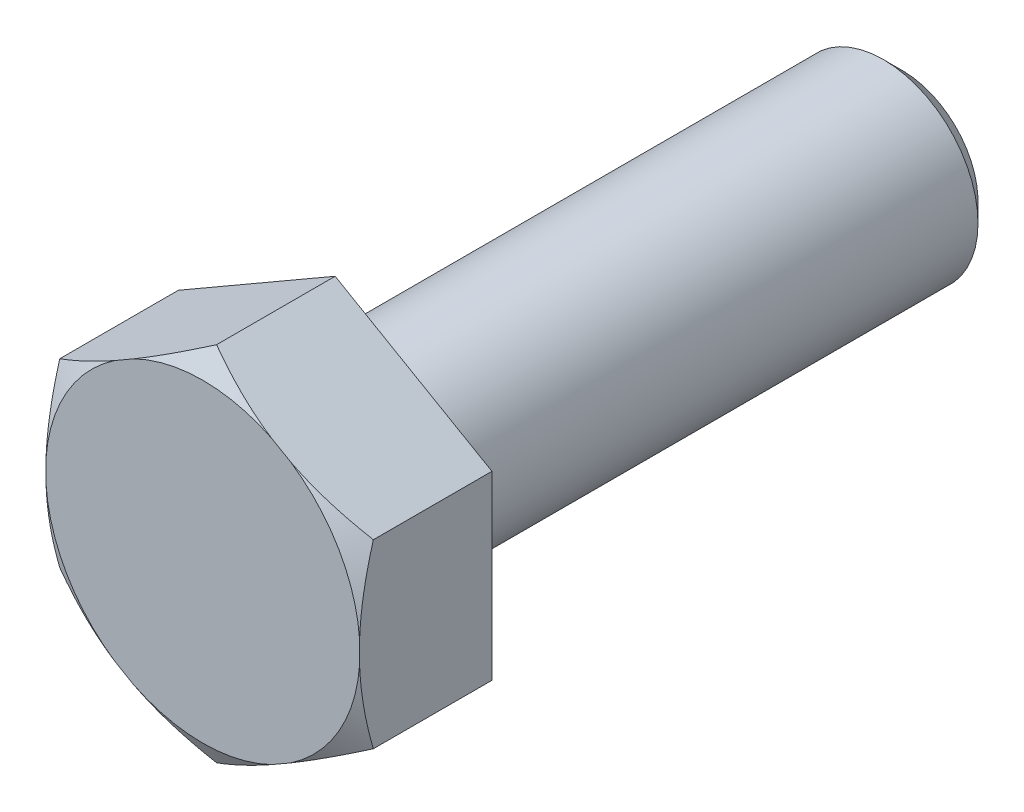
ISO-10303-21;
HEADER;
FILE_DESCRIPTION(('STEP AP214'),'2;1');
FILE_NAME('part.step','',(''),(''),'','','');
FILE_SCHEMA(('AUTOMOTIVE_DESIGN { 1 0 10303 214 1 1 1 1 }'));
ENDSEC;
DATA;
#1=APPLICATION_CONTEXT('core data for automotive mechanical design processes');
#2=APPLICATION_PROTOCOL_DEFINITION('international standard','automotive_design',2000,#1);
#3=PRODUCT_CONTEXT('',#1,'mechanical');
#4=PRODUCT('Part','Part','',(#3));
#5=PRODUCT_RELATED_PRODUCT_CATEGORY('part','',(#4));
#6=PRODUCT_DEFINITION_FORMATION('','',#4);
#7=PRODUCT_DEFINITION_CONTEXT('part definition',#1,'design');
#8=PRODUCT_DEFINITION('design','',#6,#7);
#9=PRODUCT_DEFINITION_SHAPE('','',#8);
#10=(LENGTH_UNIT() NAMED_UNIT(*) SI_UNIT(.MILLI.,.METRE.));
#11=(NAMED_UNIT(*) PLANE_ANGLE_UNIT() SI_UNIT($,.RADIAN.));
#12=(NAMED_UNIT(*) SI_UNIT($,.STERADIAN.) SOLID_ANGLE_UNIT());
#13=UNCERTAINTY_MEASURE_WITH_UNIT(LENGTH_MEASURE(1.E-05),#10,'distance_accuracy_value','');
#14=(GEOMETRIC_REPRESENTATION_CONTEXT(3) GLOBAL_UNCERTAINTY_ASSIGNED_CONTEXT((#13)) GLOBAL_UNIT_ASSIGNED_CONTEXT((#10,
#11,#12)) REPRESENTATION_CONTEXT('',''));
#15=CARTESIAN_POINT('',(0.,0.,0.));
#16=DIRECTION('',(0.,0.,1.));
#17=DIRECTION('',(1.,0.,0.));
#18=AXIS2_PLACEMENT_3D('',#15,#16,#17);
#19=CARTESIAN_POINT('',(0.,0.,0.));
#20=DIRECTION('',(0.,0.,0.999999999999983));
#21=DIRECTION('',(0.999999999999996,0.,0.));
#22=AXIS2_PLACEMENT_3D('',#19,#20,#21);
#23=PLANE('',#22);
#24=CARTESIAN_POINT('',(0.,0.,0.));
#25=DIRECTION('',(0.,0.,0.999999999999983));
#26=DIRECTION('',(0.999999999999996,0.,0.));
#27=AXIS2_PLACEMENT_3D('',#24,#25,#26);
#28=CIRCLE('',#27,3.325);
#29=CARTESIAN_POINT('',(3.31687729649477,-0.232271392986622,0.));
#30=VERTEX_POINT('',#29);
#31=CARTESIAN_POINT('',(1.85959157514623,-2.75636430350662,0.));
#32=VERTEX_POINT('',#31);
#33=EDGE_CURVE('E183',#30,#32,#28,.F.);
#34=ORIENTED_EDGE('',*,*,#33,.F.);
#35=DIRECTION('',(0.,1.,0.));
#36=VECTOR('',#35,1.);
#37=CARTESIAN_POINT('',(3.31687729649469,-1.9149999999999,0.));
#38=LINE('',#37,#36);
#39=CARTESIAN_POINT('',(3.31687729649457,0.232271392986955,0.));
#40=VERTEX_POINT('',#39);
#41=EDGE_CURVE('E309',#30,#40,#38,.T.);
#42=ORIENTED_EDGE('',*,*,#41,.T.);
#43=CARTESIAN_POINT('',(1.85959157514615,2.75636430350665,0.));
#44=VERTEX_POINT('',#43);
#45=EDGE_CURVE('E179',#44,#40,#28,.F.);
#46=ORIENTED_EDGE('',*,*,#45,.F.);
#47=DIRECTION('',(-0.866025403784435,0.499999999999998,0.));
#48=VECTOR('',#47,1.);
#49=CARTESIAN_POINT('',(3.31687729649466,1.91500000000017,0.));
#50=LINE('',#49,#48);
#51=CARTESIAN_POINT('',(1.45728572134846,2.98863569649342,0.));
#52=VERTEX_POINT('',#51);
#53=EDGE_CURVE('E318',#44,#52,#50,.T.);
#54=ORIENTED_EDGE('',*,*,#53,.T.);
#55=CARTESIAN_POINT('',(-1.45728572134823,2.98863569649344,0.));
#56=VERTEX_POINT('',#55);
#57=EDGE_CURVE('E181',#56,#52,#28,.F.);
#58=ORIENTED_EDGE('',*,*,#57,.F.);
#59=DIRECTION('',(-0.866025403784436,-0.499999999999998,0.));
#60=VECTOR('',#59,1.);
#61=CARTESIAN_POINT('',(1.11022302462516E-13,3.83000000000003,0.));
#62=LINE('',#61,#60);
#63=CARTESIAN_POINT('',(-1.85959157514597,2.75636430350665,0.));
#64=VERTEX_POINT('',#63);
#65=EDGE_CURVE('E178',#56,#64,#62,.T.);
#66=ORIENTED_EDGE('',*,*,#65,.T.);
#67=CARTESIAN_POINT('',(0.,0.,0.));
#68=DIRECTION('',(0.,0.,-0.999999999999983));
#69=DIRECTION('',(-0.999999999999996,0.,0.));
#70=AXIS2_PLACEMENT_3D('',#67,#68,#69);
#71=CIRCLE('',#70,3.325);
#72=CARTESIAN_POINT('',(-3.31687729649405,0.232271392987038,0.));
#73=VERTEX_POINT('',#72);
#74=EDGE_CURVE('E142',#73,#64,#71,.T.);
#75=ORIENTED_EDGE('',*,*,#74,.F.);
#76=DIRECTION('',(0.,-0.999999999999994,0.));
#77=VECTOR('',#76,1.);
#78=CARTESIAN_POINT('',(-3.31687729649406,1.91500000000037,0.));
#79=LINE('',#78,#77);
#80=CARTESIAN_POINT('',(-3.31687729649405,-0.232271392986594,0.));
#81=VERTEX_POINT('',#80);
#82=EDGE_CURVE('E157',#73,#81,#79,.T.);
#83=ORIENTED_EDGE('',*,*,#82,.T.);
#84=CARTESIAN_POINT('',(-1.85959157514604,-2.75636430350656,0.));
#85=VERTEX_POINT('',#84);
#86=EDGE_CURVE('E343',#85,#81,#28,.F.);
#87=ORIENTED_EDGE('',*,*,#86,.F.);
#88=DIRECTION('',(0.866025403784438,-0.5,0.));
#89=VECTOR('',#88,1.);
#90=CARTESIAN_POINT('',(-3.31687729649408,-1.91499999999982,0.));
#91=LINE('',#90,#89);
#92=CARTESIAN_POINT('',(-1.45728572134791,-2.98863569649328,0.));
#93=VERTEX_POINT('',#92);
#94=EDGE_CURVE('E166',#85,#93,#91,.T.);
#95=ORIENTED_EDGE('',*,*,#94,.T.);
#96=CARTESIAN_POINT('',(1.4572857213484,-2.98863569649332,0.));
#97=VERTEX_POINT('',#96);
#98=EDGE_CURVE('E312',#97,#93,#28,.F.);
#99=ORIENTED_EDGE('',*,*,#98,.F.);
#100=DIRECTION('',(0.866025403784433,0.499999999999997,0.));
#101=VECTOR('',#100,1.);
#102=CARTESIAN_POINT('',(2.22044604925031E-13,-3.82999999999989,0.));
#103=LINE('',#102,#101);
#104=EDGE_CURVE('E311',#97,#32,#103,.T.);
#105=ORIENTED_EDGE('',*,*,#104,.T.);
#106=EDGE_LOOP('',(#34,#42,#46,#54,#58,#66,#75,#83,#87,#95,#99,#105));
#107=FACE_BOUND('',#106,.T.);
#108=ADVANCED_FACE('F49',(#107),#23,.T.);
#109=CARTESIAN_POINT('',(-3.99999999999964,3.7470027081099E-13,-2.79999999999991));
#110=DIRECTION('',(0.,0.,-0.999999999999983));
#111=DIRECTION('',(-0.999999999999996,0.,0.));
#112=AXIS2_PLACEMENT_3D('',#109,#110,#111);
#113=PLANE('',#112);
#114=CARTESIAN_POINT('',(0.,0.,-2.79999999999989));
#115=DIRECTION('',(0.,0.,-0.999999999999983));
#116=DIRECTION('',(-0.999999999999996,0.,0.));
#117=AXIS2_PLACEMENT_3D('',#114,#115,#116);
#118=CIRCLE('',#117,2.4);
#119=CARTESIAN_POINT('',(-2.39999999999999,0.,-2.79999999999989));
#120=VERTEX_POINT('',#119);
#121=EDGE_CURVE('E14',#120,#120,#118,.F.);
#122=ORIENTED_EDGE('',*,*,#121,.T.);
#123=EDGE_LOOP('',(#122));
#124=FACE_BOUND('',#123,.T.);
#125=DIRECTION('',(-0.866025403784433,-0.499999999999997,0.));
#126=VECTOR('',#125,1.);
#127=CARTESIAN_POINT('',(1.11022302462516E-13,3.83000000000003,-2.79999999999987));
#128=LINE('',#127,#126);
#129=CARTESIAN_POINT('',(1.11022302462516E-13,3.83000000000003,-2.79999999999987));
#130=VERTEX_POINT('',#129);
#131=CARTESIAN_POINT('',(-3.31687729649406,1.91500000000037,-2.79999999999983));
#132=VERTEX_POINT('',#131);
#133=EDGE_CURVE('E164',#130,#132,#128,.T.);
#134=ORIENTED_EDGE('',*,*,#133,.F.);
#135=DIRECTION('',(-0.866025403784435,0.499999999999998,0.));
#136=VECTOR('',#135,1.);
#137=CARTESIAN_POINT('',(3.31687729649466,1.91500000000017,-2.79999999999987));
#138=LINE('',#137,#136);
#139=CARTESIAN_POINT('',(3.31687729649466,1.91500000000017,-2.79999999999987));
#140=VERTEX_POINT('',#139);
#141=EDGE_CURVE('E327',#140,#130,#138,.T.);
#142=ORIENTED_EDGE('',*,*,#141,.F.);
#143=DIRECTION('',(0.,1.,0.));
#144=VECTOR('',#143,1.);
#145=CARTESIAN_POINT('',(3.31687729649466,-1.91499999999983,-2.79999999999999));
#146=LINE('',#145,#144);
#147=CARTESIAN_POINT('',(3.31687729649466,-1.91499999999983,-2.79999999999999));
#148=VERTEX_POINT('',#147);
#149=EDGE_CURVE('E323',#148,#140,#146,.T.);
#150=ORIENTED_EDGE('',*,*,#149,.F.);
#151=DIRECTION('',(0.866025403784437,0.499999999999998,0.));
#152=VECTOR('',#151,1.);
#153=CARTESIAN_POINT('',(1.94289029309402E-13,-3.82999999999994,-2.79999999999991));
#154=LINE('',#153,#152);
#155=CARTESIAN_POINT('',(1.94289029309402E-13,-3.82999999999994,-2.79999999999991));
#156=VERTEX_POINT('',#155);
#157=EDGE_CURVE('E182',#156,#148,#154,.T.);
#158=ORIENTED_EDGE('',*,*,#157,.F.);
#159=DIRECTION('',(0.866025403784438,-0.5,0.));
#160=VECTOR('',#159,1.);
#161=CARTESIAN_POINT('',(-3.31687729649409,-1.91499999999978,-2.79999999999991));
#162=LINE('',#161,#160);
#163=CARTESIAN_POINT('',(-3.31687729649409,-1.91499999999978,-2.79999999999991));
#164=VERTEX_POINT('',#163);
#165=EDGE_CURVE('E333',#164,#156,#162,.T.);
#166=ORIENTED_EDGE('',*,*,#165,.F.);
#167=DIRECTION('',(0.,-0.999999999999994,0.));
#168=VECTOR('',#167,1.);
#169=CARTESIAN_POINT('',(-3.31687729649406,1.91500000000037,-2.79999999999983));
#170=LINE('',#169,#168);
#171=EDGE_CURVE('E336',#132,#164,#170,.T.);
#172=ORIENTED_EDGE('',*,*,#171,.F.);
#173=EDGE_LOOP('',(#134,#142,#150,#158,#166,#172));
#174=FACE_BOUND('',#173,.T.);
#175=ADVANCED_FACE('F205',(#124,#174),#113,.T.);
#176=CARTESIAN_POINT('',(0.,0.,-14.7999999999997));
#177=DIRECTION('',(0.,0.,-0.999999999999983));
#178=DIRECTION('',(-0.999999999999996,0.,0.));
#179=AXIS2_PLACEMENT_3D('',#176,#177,#178);
#180=CYLINDRICAL_SURFACE('',#179,2.);
#181=CARTESIAN_POINT('',(0.,0.,-3.19999999999989));
#182=DIRECTION('',(0.,0.,-0.999999999999983));
#183=DIRECTION('',(-0.999999999999996,0.,0.));
#184=AXIS2_PLACEMENT_3D('',#181,#182,#183);
#185=CIRCLE('',#184,2.);
#186=CARTESIAN_POINT('',(-1.99999999999999,0.,-3.19999999999989));
#187=VERTEX_POINT('',#186);
#188=EDGE_CURVE('E57',#187,#187,#185,.T.);
#189=ORIENTED_EDGE('',*,*,#188,.T.);
#190=EDGE_LOOP('',(#189));
#191=FACE_BOUND('',#190,.T.);
#192=CARTESIAN_POINT('',(0.,0.,-14.3999999999997));
#193=DIRECTION('',(0.,0.,-0.999999999999983));
#194=DIRECTION('',(-0.999999999999996,0.,0.));
#195=AXIS2_PLACEMENT_3D('',#192,#193,#194);
#196=CIRCLE('',#195,2.);
#197=CARTESIAN_POINT('',(-1.99999999999999,0.,-14.3999999999997));
#198=VERTEX_POINT('',#197);
#199=EDGE_CURVE('E187',#198,#198,#196,.F.);
#200=ORIENTED_EDGE('',*,*,#199,.T.);
#201=EDGE_LOOP('',(#200));
#202=FACE_BOUND('',#201,.T.);
#203=ADVANCED_FACE('F192',(#191,#202),#180,.T.);
#204=CARTESIAN_POINT('',(-1.99999999999995,0.,-14.7999999999996));
#205=DIRECTION('',(0.,0.,-0.999999999999983));
#206=DIRECTION('',(-0.999999999999996,0.,0.));
#207=AXIS2_PLACEMENT_3D('',#204,#205,#206);
#208=PLANE('',#207);
#209=CARTESIAN_POINT('',(0.,0.,-14.7999999999997));
#210=DIRECTION('',(0.,0.,-0.999999999999983));
#211=DIRECTION('',(-0.999999999999996,0.,0.));
#212=AXIS2_PLACEMENT_3D('',#209,#210,#211);
#213=CIRCLE('',#212,1.6);
#214=CARTESIAN_POINT('',(-1.59999999999999,0.,-14.7999999999997));
#215=VERTEX_POINT('',#214);
#216=EDGE_CURVE('E184',#215,#215,#213,.T.);
#217=ORIENTED_EDGE('',*,*,#216,.T.);
#218=EDGE_LOOP('',(#217));
#219=FACE_BOUND('',#218,.T.);
#220=ADVANCED_FACE('F217',(#219),#208,.T.);
#221=CARTESIAN_POINT('',(3.31687729649469,1.91500000000011,-14.2551298552219));
#222=DIRECTION('',(0.499999999999998,0.866025403784435,0.));
#223=DIRECTION('',(-0.866025403784435,0.499999999999998,0.));
#224=AXIS2_PLACEMENT_3D('',#221,#222,#223);
#225=PLANE('',#224);
#226=CARTESIAN_POINT('',(5.62172629363067,0.584294811062119,-1.3434993343903));
#227=CARTESIAN_POINT('',(5.51750239060648,0.644468509529189,-1.28725167208016));
#228=CARTESIAN_POINT('',(5.4130292532571,0.704786103500962,-1.2316103271576));
#229=CARTESIAN_POINT('',(5.20347942037262,0.825769755925475,-1.12182497272101));
#230=CARTESIAN_POINT('',(5.09840265091867,0.886435857055285,-1.06768115152197));
#231=CARTESIAN_POINT('',(4.88722864154449,1.00835722821331,-0.961019118310309));
#232=CARTESIAN_POINT('',(4.78112921034729,1.06961376337588,-0.90850667265742));
#233=CARTESIAN_POINT('',(4.56813590600311,1.19258550497459,-0.805680571313846));
#234=CARTESIAN_POINT('',(4.46124205817845,1.25430069679087,-0.755366845886894));
#235=CARTESIAN_POINT('',(4.2437984119913,1.37984184445059,-0.65617223135669));
#236=CARTESIAN_POINT('',(4.13322484720153,1.44368152184722,-0.607360490360517));
#237=CARTESIAN_POINT('',(3.91096100065247,1.57200561348344,-0.513209643081533));
#238=CARTESIAN_POINT('',(3.79927065089425,1.63649006698224,-0.467870749727474));
#239=CARTESIAN_POINT('',(3.57475351404745,1.76611509637842,-0.381529270760591));
#240=CARTESIAN_POINT('',(3.46192797603732,1.83125495112003,-0.340522391210607));
#241=CARTESIAN_POINT('',(3.2349413118943,1.96230576276547,-0.263789020052963));
#242=CARTESIAN_POINT('',(3.12078029875782,2.0282166544308,-0.228062085139603));
#243=CARTESIAN_POINT('',(2.8478189886034,2.18581094032681,-0.150779586359144));
#244=CARTESIAN_POINT('',(2.68839276078281,2.27785571587489,-0.112092988464671));
#245=CARTESIAN_POINT('',(2.36727550688925,2.46325284885175,-0.0501062405236517));
#246=CARTESIAN_POINT('',(2.20558529212221,2.55660473787283,-0.0268007157970964));
#247=CARTESIAN_POINT('',(1.96313191693464,2.69658525930332,-0.00531895884539625));
#248=CARTESIAN_POINT('',(1.88279263235805,2.74296916688012,-0.000394837495243021));
#249=CARTESIAN_POINT('',(1.7219970208446,2.83580455647191,0.004967539705456));
#250=CARTESIAN_POINT('',(1.64154069515291,2.882256037768,0.00540584293536431));
#251=CARTESIAN_POINT('',(1.48070297743578,2.97511573738787,0.00177609392440867));
#252=CARTESIAN_POINT('',(1.40032158813878,3.02152395413638,-0.00229211644284773));
#253=CARTESIAN_POINT('',(1.23981324881629,3.11419348705125,-0.0148097388616338));
#254=CARTESIAN_POINT('',(1.15968631688761,3.16045479276942,-0.023259455799578));
#255=CARTESIAN_POINT('',(0.970482918174992,3.26969142594765,-0.0481712002887221));
#256=CARTESIAN_POINT('',(0.861583155005844,3.33256473352831,-0.0664362042317106));
#257=CARTESIAN_POINT('',(0.644823571132267,3.45771093762734,-0.109866469692268));
#258=CARTESIAN_POINT('',(0.536963904071402,3.51998374543956,-0.135032734981148));
#259=CARTESIAN_POINT('',(0.322298711809833,3.64392075197737,-0.191315596723954));
#260=CARTESIAN_POINT('',(0.215494521329859,3.70558418010159,-0.222438911308774));
#261=CARTESIAN_POINT('',(0.00308429644430142,3.8282192806179,-0.289655544512568));
#262=CARTESIAN_POINT('',(-0.102521813305815,3.88919099651019,-0.325748548702821));
#263=CARTESIAN_POINT('',(-0.31386293594174,4.01120885055489,-0.402500734841856));
#264=CARTESIAN_POINT('',(-0.41958439576251,4.07224716384154,-0.443209347985084));
#265=CARTESIAN_POINT('',(-0.629904407731453,4.19367547936775,-0.528055943094412));
#266=CARTESIAN_POINT('',(-0.734503652778316,4.25406588165254,-0.572191651621964));
#267=CARTESIAN_POINT('',(-1.04686737770612,4.43440916232486,-0.70879646679862));
#268=CARTESIAN_POINT('',(-1.2532504559821,4.55356448812419,-0.805483077200813));
#269=CARTESIAN_POINT('',(-1.52973841936999,4.71319488821351,-0.941034706860773));
#270=CARTESIAN_POINT('',(-1.6011012520847,4.7543962388913,-0.976568885707778));
#271=CARTESIAN_POINT('',(-1.74351306044048,4.83661773478114,-1.0484640977588));
#272=CARTESIAN_POINT('',(-1.81456204648264,4.87763788599828,-1.08482510331195));
#273=CARTESIAN_POINT('',(-1.95562500708552,4.95908062427508,-1.15788245032702));
#274=CARTESIAN_POINT('',(-2.025641964322,4.99950493338341,-1.19457113908892));
#275=CARTESIAN_POINT('',(-2.16542641207161,5.08020952192012,-1.26858074581908));
#276=CARTESIAN_POINT('',(-2.23519389819151,5.12048979881209,-1.30590167485541));
#277=CARTESIAN_POINT('',(-2.30484899713596,5.16070518893805,-1.34349933439029));
#278=B_SPLINE_CURVE_WITH_KNOTS('',3,(#226,#227,#228,#229,#230,#231,#232,#233,#234,#235,#236,
#237,#238,#239,#240,#241,#242,#243,#244,#245,#246,#247,#248,#249,#250,#251,#252,#253,#254,#255,
#256,#257,#258,#259,#260,#261,#262,#263,#264,#265,#266,#267,#268,#269,#270,#271,#272,#273,#274,
#275,#276,#277),.UNSPECIFIED.,.F.,.F.,(4,2,2,2,2,2,2,2,2,2,2,2,2,2,2,2,2,2,2,2,2,2,2,2,2,4),(0.,
0.398533636659788,0.797117163512729,1.1969781739285,1.59682649283293,2.00686036937098,
2.41691936599541,2.82656801693037,3.23618225408048,3.7999982001106,4.36361702484875,
4.64221895453416,4.92081794161354,5.19942670459779,5.47805485712915,5.85902313260719,
6.24004684839045,6.62150282726741,7.00293468277663,7.3889266616523,7.7746647366572,
8.54594940820009,8.81516386294476,9.08436932777878,9.35071814537418,9.61707163053138),.UNSPECIFIED.);
#279=CARTESIAN_POINT('',(3.31687729649466,1.91500000000017,-0.291561885940761));
#280=VERTEX_POINT('',#279);
#281=EDGE_CURVE('E236',#280,#44,#278,.T.);
#282=ORIENTED_EDGE('',*,*,#281,.F.);
#283=DIRECTION('',(0.,0.,0.999999999999983));
#284=VECTOR('',#283,1.);
#285=CARTESIAN_POINT('',(3.31687729649469,1.91500000000011,-14.2551298552219));
#286=LINE('',#285,#284);
#287=EDGE_CURVE('E326',#140,#280,#286,.T.);
#288=ORIENTED_EDGE('',*,*,#287,.F.);
#289=ORIENTED_EDGE('',*,*,#141,.T.);
#290=DIRECTION('',(0.,0.,0.999999999999983));
#291=VECTOR('',#290,1.);
#292=CARTESIAN_POINT('',(5.82867087928207E-13,3.83000000000024,-14.2551298552219));
#293=LINE('',#292,#291);
#294=CARTESIAN_POINT('',(1.11022302462516E-13,3.83000000000003,-0.291561885940761));
#295=VERTEX_POINT('',#294);
#296=EDGE_CURVE('E168',#130,#295,#293,.T.);
#297=ORIENTED_EDGE('',*,*,#296,.T.);
#298=EDGE_CURVE('E230',#52,#295,#278,.T.);
#299=ORIENTED_EDGE('',*,*,#298,.F.);
#300=ORIENTED_EDGE('',*,*,#53,.F.);
#301=EDGE_LOOP('',(#282,#288,#289,#297,#299,#300));
#302=FACE_BOUND('',#301,.T.);
#303=ADVANCED_FACE('F220',(#302),#225,.T.);
#304=CARTESIAN_POINT('',(3.31687729649482,-1.9149999999996,-14.2551298552219));
#305=DIRECTION('',(1.,0.,0.));
#306=DIRECTION('',(0.,1.,0.));
#307=AXIS2_PLACEMENT_3D('',#304,#305,#306);
#308=PLANE('',#307);
#309=CARTESIAN_POINT('',(3.3168772964948,-4.219848997136,-1.17917039043227));
#310=CARTESIAN_POINT('',(3.31687729649482,-4.10000949336628,-1.12478805347096));
#311=CARTESIAN_POINT('',(3.31687729649482,-3.97984254129514,-1.07111397821082));
#312=CARTESIAN_POINT('',(3.31687729649483,-3.73871307818964,-0.9655258155449));
#313=CARTESIAN_POINT('',(3.31687729649483,-3.61775042780805,-0.913612046770637));
#314=CARTESIAN_POINT('',(3.31687729649482,-3.37442550283469,-0.811695663946804));
#315=CARTESIAN_POINT('',(3.31687729649482,-3.25205949458787,-0.76170192591391));
#316=CARTESIAN_POINT('',(3.31687729649483,-3.00629486118468,-0.664331057872121));
#317=CARTESIAN_POINT('',(3.31687729649483,-2.88289628379578,-0.616953807584631));
#318=CARTESIAN_POINT('',(3.31687729649482,-2.63546003382872,-0.525599468441985));
#319=CARTESIAN_POINT('',(3.31687729649482,-2.51142765851419,-0.481608170452465));
#320=CARTESIAN_POINT('',(3.31687729649483,-2.26205366968847,-0.397515974193879));
#321=CARTESIAN_POINT('',(3.31687729649483,-2.13671197321862,-0.357415324112971));
#322=CARTESIAN_POINT('',(3.31687729649481,-1.75885360678002,-0.244320609772334));
#323=CARTESIAN_POINT('',(3.31687729649476,-1.5040975929607,-0.178378158068829));
#324=CARTESIAN_POINT('',(3.31687729649478,-1.06189130491924,-0.0885886296741389));
#325=CARTESIAN_POINT('',(3.31687729649481,-0.875808171654392,-0.0581091142761337));
#326=CARTESIAN_POINT('',(3.31687729649483,-0.501622663468174,-0.0142041380386108));
#327=CARTESIAN_POINT('',(3.31687729649482,-0.313520984801959,-0.00077297604463446));
#328=CARTESIAN_POINT('',(3.31687729649483,0.0630047324713629,0.00742224037580609));
#329=CARTESIAN_POINT('',(3.31687729649486,0.251428543902733,0.00219630896709504));
#330=CARTESIAN_POINT('',(3.31687729649479,0.626879705184949,-0.0262406018741827));
#331=CARTESIAN_POINT('',(3.31687729649468,0.813906816709302,-0.0494545829691247));
#332=CARTESIAN_POINT('',(3.31687729649463,1.27844227697725,-0.126826721919229));
#333=CARTESIAN_POINT('',(3.31687729649479,1.55431995910594,-0.190662587733559));
#334=CARTESIAN_POINT('',(3.31687729649484,1.96309568301154,-0.304502553025458));
#335=CARTESIAN_POINT('',(3.31687729649483,2.09869210615887,-0.345530608546381));
#336=CARTESIAN_POINT('',(3.31687729649482,2.36831431944322,-0.432479205036366));
#337=CARTESIAN_POINT('',(3.31687729649482,2.50234021918169,-0.478399402315227));
#338=CARTESIAN_POINT('',(3.31687729649482,2.77049868768288,-0.574716532223731));
#339=CARTESIAN_POINT('',(3.31687729649482,2.90461473734128,-0.625158898345523));
#340=CARTESIAN_POINT('',(3.31687729649482,3.17159358691107,-0.729272474236708));
#341=CARTESIAN_POINT('',(3.31687729649482,3.30445630725307,-0.782943887431974));
#342=CARTESIAN_POINT('',(3.31687729649483,3.56827338615303,-0.892538965806642));
#343=CARTESIAN_POINT('',(3.31687729649483,3.69923447779776,-0.948446507284659));
#344=CARTESIAN_POINT('',(3.31687729649481,3.96020721757652,-1.0623521779206));
#345=CARTESIAN_POINT('',(3.31687729649478,4.090219092274,-1.12034978719507));
#346=CARTESIAN_POINT('',(3.31687729649471,4.21984899713622,-1.17917039043226));
#347=B_SPLINE_CURVE_WITH_KNOTS('',3,(#309,#310,#311,#312,#313,#314,#315,#316,#317,#318,#319,
#320,#321,#322,#323,#324,#325,#326,#327,#328,#329,#330,#331,#332,#333,#334,#335,#336,#337,#338,
#339,#340,#341,#342,#343,#344,#345,#346),.UNSPECIFIED.,.F.,.F.,(4,2,2,2,2,2,2,2,2,2,2,2,2,2,2,2,
2,2,4),(0.,0.394810216599131,0.789691520042419,1.1862201149506,1.58273046644481,
1.97747413628948,2.37224297067749,3.16047837207754,3.725525204131,4.29038302856418,
4.85493771206365,5.41958662298686,6.26722815435192,6.69218728492864,7.11711658029148,
7.54693554202089,7.97678161021196,8.40394840888899,8.83100967771644),.UNSPECIFIED.);
#348=CARTESIAN_POINT('',(3.31687729649463,-1.91499999999993,-0.291561885940761));
#349=VERTEX_POINT('',#348);
#350=EDGE_CURVE('E268',#349,#30,#347,.T.);
#351=ORIENTED_EDGE('',*,*,#350,.F.);
#352=DIRECTION('',(0.,0.,0.999999999999983));
#353=VECTOR('',#352,1.);
#354=CARTESIAN_POINT('',(3.31687729649482,-1.9149999999996,-14.2551298552219));
#355=LINE('',#354,#353);
#356=EDGE_CURVE('E316',#148,#349,#355,.T.);
#357=ORIENTED_EDGE('',*,*,#356,.F.);
#358=ORIENTED_EDGE('',*,*,#149,.T.);
#359=ORIENTED_EDGE('',*,*,#287,.T.);
#360=EDGE_CURVE('E305',#40,#280,#347,.T.);
#361=ORIENTED_EDGE('',*,*,#360,.F.);
#362=ORIENTED_EDGE('',*,*,#41,.F.);
#363=EDGE_LOOP('',(#351,#357,#358,#359,#361,#362));
#364=FACE_BOUND('',#363,.T.);
#365=ADVANCED_FACE('F225',(#364),#308,.T.);
#366=CARTESIAN_POINT('',(3.05311331771918E-13,-3.82999999999985,-14.2551298552217));
#367=DIRECTION('',(0.499999999999998,-0.866025403784437,0.));
#368=DIRECTION('',(0.866025403784437,0.499999999999998,0.));
#369=AXIS2_PLACEMENT_3D('',#366,#367,#368);
#370=PLANE('',#369);
#371=CARTESIAN_POINT('',(-2.30484899713573,-5.16070518893795,-1.3434993343902));
#372=CARTESIAN_POINT('',(-2.2006250941116,-5.10053149047086,-1.28725167207996));
#373=CARTESIAN_POINT('',(-2.09615195676225,-5.04021389649908,-1.23161032715737));
#374=CARTESIAN_POINT('',(-1.88660212387779,-4.91923024407456,-1.12182497272075));
#375=CARTESIAN_POINT('',(-1.78152535442383,-4.85856414294476,-1.06768115152173));
#376=CARTESIAN_POINT('',(-1.57035134504965,-4.73664277178673,-0.961019118310074));
#377=CARTESIAN_POINT('',(-1.46425191385245,-4.67538623662416,-0.908506672657185));
#378=CARTESIAN_POINT('',(-1.25125860950828,-4.55241449502547,-0.805680571313614));
#379=CARTESIAN_POINT('',(-1.14436476168362,-4.49069930320919,-0.755366845886666));
#380=CARTESIAN_POINT('',(-0.926921115496487,-4.36515815554947,-0.656172231356468));
#381=CARTESIAN_POINT('',(-0.816347550706728,-4.30131847815284,-0.607360490360298));
#382=CARTESIAN_POINT('',(-0.594083704157678,-4.17299438651663,-0.513209643081327));
#383=CARTESIAN_POINT('',(-0.482393354399467,-4.10850993301784,-0.467870749727281));
#384=CARTESIAN_POINT('',(-0.257876217552685,-3.97888490362167,-0.381529270760389));
#385=CARTESIAN_POINT('',(-0.145050679542566,-3.91374504888006,-0.340522391210384));
#386=CARTESIAN_POINT('',(0.0819359846004654,-3.78269423723463,-0.263789020052814));
#387=CARTESIAN_POINT('',(0.196096997736973,-3.71678334556931,-0.228062085139548));
#388=CARTESIAN_POINT('',(0.469058307891419,-3.55918905967329,-0.150779586359131));
#389=CARTESIAN_POINT('',(0.628484535711987,-3.46714428412519,-0.112092988464538));
#390=CARTESIAN_POINT('',(0.949601789605547,-3.28174715114831,-0.0501062405234405));
#391=CARTESIAN_POINT('',(1.11129200437261,-3.18839526212722,-0.0268007157969277));
#392=CARTESIAN_POINT('',(1.35374537956021,-3.04841474069673,-0.00531895884525219));
#393=CARTESIAN_POINT('',(1.43408466413681,-3.00203083311992,-0.000394837495100746));
#394=CARTESIAN_POINT('',(1.59488027565027,-2.90919544352812,0.00496753970558616));
#395=CARTESIAN_POINT('',(1.67533660134196,-2.86274396223201,0.0054058429354842));
#396=CARTESIAN_POINT('',(1.83617431905913,-2.76988426261216,0.00177609392452323));
#397=CARTESIAN_POINT('',(1.91655570835615,-2.72347604586367,-0.00229211644272828));
#398=CARTESIAN_POINT('',(2.0770640476786,-2.63080651294871,-0.0148097388615648));
#399=CARTESIAN_POINT('',(2.15719097960722,-2.58454520723042,-0.0232594557995643));
#400=CARTESIAN_POINT('',(2.34639437831983,-2.47530857405212,-0.0481712002887492));
#401=CARTESIAN_POINT('',(2.45529414148909,-2.41243526647161,-0.0664362042316901));
#402=CARTESIAN_POINT('',(2.67205372536276,-2.28728906237268,-0.10986646969223));
#403=CARTESIAN_POINT('',(2.77991339242361,-2.22501625456041,-0.13503273498114));
#404=CARTESIAN_POINT('',(2.99457858468517,-2.10107924802256,-0.191315596723984));
#405=CARTESIAN_POINT('',(3.10138277516516,-2.03941581989835,-0.222438911308811));
#406=CARTESIAN_POINT('',(3.31379300005074,-1.91678071938203,-0.289655544512628));
#407=CARTESIAN_POINT('',(3.41939910980086,-1.85580900348973,-0.325748548702896));
#408=CARTESIAN_POINT('',(3.6307402324368,-1.73379114944504,-0.402500734841951));
#409=CARTESIAN_POINT('',(3.73646169225758,-1.67275283615839,-0.443209347985184));
#410=CARTESIAN_POINT('',(3.94678170422652,-1.55132452063215,-0.528055943094551));
#411=CARTESIAN_POINT('',(4.05138094927336,-1.49093411834732,-0.572191651622139));
#412=CARTESIAN_POINT('',(4.36374467420131,-1.31059083767513,-0.708796466798727));
#413=CARTESIAN_POINT('',(4.57012775247767,-1.19143551187618,-0.805483077200643));
#414=CARTESIAN_POINT('',(4.84661571586527,-1.03180511178659,-0.941034706860819));
#415=CARTESIAN_POINT('',(4.91797854857981,-0.990603761108681,-0.976568885707921));
#416=CARTESIAN_POINT('',(5.06039035693542,-0.908382265218762,-1.048464097759));
#417=CARTESIAN_POINT('',(5.13143934297758,-0.867362114001681,-1.0848251033121));
#418=CARTESIAN_POINT('',(5.27250230358043,-0.785919375724949,-1.15788245032712));
#419=CARTESIAN_POINT('',(5.34251926081688,-0.745495066616645,-1.19457113908902));
#420=CARTESIAN_POINT('',(5.48230370856641,-0.664790478079928,-1.26858074581916));
#421=CARTESIAN_POINT('',(5.55207119468626,-0.624510201187941,-1.30590167485547));
#422=CARTESIAN_POINT('',(5.62172629363067,-0.584294811061953,-1.34349933439029));
#423=B_SPLINE_CURVE_WITH_KNOTS('',3,(#371,#372,#373,#374,#375,#376,#377,#378,#379,#380,#381,
#382,#383,#384,#385,#386,#387,#388,#389,#390,#391,#392,#393,#394,#395,#396,#397,#398,#399,#400,
#401,#402,#403,#404,#405,#406,#407,#408,#409,#410,#411,#412,#413,#414,#415,#416,#417,#418,#419,
#420,#421,#422),.UNSPECIFIED.,.F.,.F.,(4,2,2,2,2,2,2,2,2,2,2,2,2,2,2,2,2,2,2,2,2,2,2,2,2,4),(0.,
0.398533636659789,0.797117163512728,1.19697817392848,1.5968264928329,2.00686036937092,
2.41691936599532,2.82656801693026,3.23618225408035,3.79999820011052,4.36361702484872,
4.64221895453415,4.92081794161356,5.19942670459784,5.47805485712923,5.85902313260731,
6.24004684839063,6.62150282726762,7.00293468277687,7.38892666165257,7.77466473665751,
8.54594940820045,8.81516386294501,9.08436932777891,9.35071814537419,9.61707163053129),.UNSPECIFIED.);
#424=CARTESIAN_POINT('',(2.22044604925031E-13,-3.82999999999989,-0.291561885940726));
#425=VERTEX_POINT('',#424);
#426=EDGE_CURVE('E64',#425,#97,#423,.T.);
#427=ORIENTED_EDGE('',*,*,#426,.F.);
#428=DIRECTION('',(0.,0.,0.999999999999983));
#429=VECTOR('',#428,1.);
#430=CARTESIAN_POINT('',(3.05311331771918E-13,-3.82999999999985,-14.2551298552217));
#431=LINE('',#430,#429);
#432=EDGE_CURVE('E315',#156,#425,#431,.T.);
#433=ORIENTED_EDGE('',*,*,#432,.F.);
#434=ORIENTED_EDGE('',*,*,#157,.T.);
#435=ORIENTED_EDGE('',*,*,#356,.T.);
#436=EDGE_CURVE('E266',#32,#349,#423,.T.);
#437=ORIENTED_EDGE('',*,*,#436,.F.);
#438=ORIENTED_EDGE('',*,*,#104,.F.);
#439=EDGE_LOOP('',(#427,#433,#434,#435,#437,#438));
#440=FACE_BOUND('',#439,.T.);
#441=ADVANCED_FACE('F273',(#440),#370,.T.);
#442=CARTESIAN_POINT('',(-3.31687729649399,-1.91499999999979,-14.2551298552217));
#443=DIRECTION('',(-0.5,-0.866025403784438,0.));
#444=DIRECTION('',(0.866025403784438,-0.5,0.));
#445=AXIS2_PLACEMENT_3D('',#442,#443,#444);
#446=PLANE('',#445);
#447=CARTESIAN_POINT('',(-5.62172629363022,-0.584294811062008,-1.34349933439037));
#448=CARTESIAN_POINT('',(-5.51750239060602,-0.644468509528861,-1.28725167207999));
#449=CARTESIAN_POINT('',(-5.41302925325663,-0.704786103500548,-1.23161032715733));
#450=CARTESIAN_POINT('',(-5.20347942037213,-0.825769755925004,-1.12182497272066));
#451=CARTESIAN_POINT('',(-5.09840265091817,-0.886435857054842,-1.06768115152164));
#452=CARTESIAN_POINT('',(-4.88722864154399,-1.00835722821289,-0.961019118309986));
#453=CARTESIAN_POINT('',(-4.78112921034679,-1.06961376337545,-0.908506672657087));
#454=CARTESIAN_POINT('',(-4.56813590600262,-1.19258550497415,-0.805680571313505));
#455=CARTESIAN_POINT('',(-4.46124205817796,-1.25430069679043,-0.755366845886554));
#456=CARTESIAN_POINT('',(-4.24379841199082,-1.37984184445015,-0.656172231356344));
#457=CARTESIAN_POINT('',(-4.13322484720105,-1.44368152184678,-0.607360490360164));
#458=CARTESIAN_POINT('',(-3.910961000652,-1.572005613483,-0.513209643081188));
#459=CARTESIAN_POINT('',(-3.79927065089378,-1.6364900669818,-0.467870749727145));
#460=CARTESIAN_POINT('',(-3.57475351404699,-1.76611509637796,-0.381529270760213));
#461=CARTESIAN_POINT('',(-3.46192797603685,-1.83125495111954,-0.340522391210165));
#462=CARTESIAN_POINT('',(-3.23494131189382,-1.96230576276506,-0.263789020052676));
#463=CARTESIAN_POINT('',(-3.12078029875733,-2.02821665443051,-0.228062085139533));
#464=CARTESIAN_POINT('',(-2.8478189886029,-2.18581094032658,-0.150779586359162));
#465=CARTESIAN_POINT('',(-2.68839276078231,-2.27785571587451,-0.112092988464393));
#466=CARTESIAN_POINT('',(-2.36727550688876,-2.46325284885126,-0.0501062405231705));
#467=CARTESIAN_POINT('',(-2.20558529212174,-2.55660473787238,-0.0268007157967071));
#468=CARTESIAN_POINT('',(-1.96313191693419,-2.69658525930286,-0.00531895884503568));
#469=CARTESIAN_POINT('',(-1.88279263235759,-2.74296916687965,-0.000394837494874229));
#470=CARTESIAN_POINT('',(-1.72199702084416,-2.83580455647145,0.00496753970581481));
#471=CARTESIAN_POINT('',(-1.64154069515249,-2.88225603776755,0.00540584293570509));
#472=CARTESIAN_POINT('',(-1.48070297743533,-2.97511573738738,0.00177609392478136));
#473=CARTESIAN_POINT('',(-1.40032158813829,-3.02152395413582,-0.00229211644242542));
#474=CARTESIAN_POINT('',(-1.23981324881592,-3.11419348705087,-0.0148097388613609));
#475=CARTESIAN_POINT('',(-1.15968631688739,-3.16045479276927,-0.0232594557995043));
#476=CARTESIAN_POINT('',(-0.970482918174809,-3.26969142594763,-0.0481712002887433));
#477=CARTESIAN_POINT('',(-0.861583155005423,-3.33256473352799,-0.0664362042314896));
#478=CARTESIAN_POINT('',(-0.644823571131649,-3.45771093762682,-0.109866469691886));
#479=CARTESIAN_POINT('',(-0.536963904070825,-3.51998374543914,-0.135032734980847));
#480=CARTESIAN_POINT('',(-0.322298711809271,-3.64392075197702,-0.191315596723729));
#481=CARTESIAN_POINT('',(-0.215494521329273,-3.70558418010122,-0.222438911308543));
#482=CARTESIAN_POINT('',(-0.00308429644368388,-3.82821928061753,-0.28965554451235));
#483=CARTESIAN_POINT('',(0.10252181330644,-3.88919099650983,-0.325748548702622));
#484=CARTESIAN_POINT('',(0.313862935942382,-4.01120885055454,-0.402500734841687));
#485=CARTESIAN_POINT('',(0.419584395763163,-4.0722471638412,-0.443209347984927));
#486=CARTESIAN_POINT('',(0.629904407732125,-4.19367547936742,-0.528055943094281));
#487=CARTESIAN_POINT('',(0.734503652778996,-4.25406588165222,-0.572191651621848));
#488=CARTESIAN_POINT('',(1.04686737770684,-4.43440916232455,-0.708796466798541));
#489=CARTESIAN_POINT('',(1.25325045598287,-4.55356448812387,-0.805483077200743));
#490=CARTESIAN_POINT('',(1.52973841937075,-4.71319488821321,-0.94103470686074));
#491=CARTESIAN_POINT('',(1.60110125208544,-4.754396238891,-0.976568885707749));
#492=CARTESIAN_POINT('',(1.74351306044119,-4.83661773478084,-1.04846409775878));
#493=CARTESIAN_POINT('',(1.81456204648332,-4.87763788599797,-1.08482510331192));
#494=CARTESIAN_POINT('',(1.95562500708619,-4.95908062427474,-1.15788245032698));
#495=CARTESIAN_POINT('',(2.02564196432268,-4.99950493338304,-1.19457113908887));
#496=CARTESIAN_POINT('',(2.16542641207222,-5.08020952191979,-1.26858074581905));
#497=CARTESIAN_POINT('',(2.23519389819205,-5.12048979881182,-1.30590167485541));
#498=CARTESIAN_POINT('',(2.30484899713634,-5.16070518893794,-1.34349933439037));
#499=B_SPLINE_CURVE_WITH_KNOTS('',3,(#447,#448,#449,#450,#451,#452,#453,#454,#455,#456,#457,
#458,#459,#460,#461,#462,#463,#464,#465,#466,#467,#468,#469,#470,#471,#472,#473,#474,#475,#476,
#477,#478,#479,#480,#481,#482,#483,#484,#485,#486,#487,#488,#489,#490,#491,#492,#493,#494,#495,
#496,#497,#498),.UNSPECIFIED.,.F.,.F.,(4,2,2,2,2,2,2,2,2,2,2,2,2,2,2,2,2,2,2,2,2,2,2,2,2,4),(0.,
0.398533636659826,0.797117163512799,1.19697817392856,1.59682649283299,2.00686036937103,
2.41691936599544,2.82656801693042,3.23618225408055,3.79999820011066,4.36361702484877,
4.64221895453416,4.92081794161352,5.19942670459777,5.47805485712914,5.85902313260726,
6.24004684839059,6.62150282726759,7.00293468277687,7.38892666165257,7.77466473665752,
8.54594940820052,8.81516386294514,9.08436932777912,9.35071814537447,9.61707163053163),.UNSPECIFIED.);
#500=CARTESIAN_POINT('',(-3.31687729649408,-1.91499999999982,-0.291561885940726));
#501=VERTEX_POINT('',#500);
#502=EDGE_CURVE('E72',#501,#85,#499,.T.);
#503=ORIENTED_EDGE('',*,*,#502,.F.);
#504=DIRECTION('',(0.,0.,0.999999999999983));
#505=VECTOR('',#504,1.);
#506=CARTESIAN_POINT('',(-3.31687729649399,-1.91499999999979,-14.2551298552217));
#507=LINE('',#506,#505);
#508=EDGE_CURVE('E171',#164,#501,#507,.T.);
#509=ORIENTED_EDGE('',*,*,#508,.F.);
#510=ORIENTED_EDGE('',*,*,#165,.T.);
#511=ORIENTED_EDGE('',*,*,#432,.T.);
#512=EDGE_CURVE('E267',#93,#425,#499,.T.);
#513=ORIENTED_EDGE('',*,*,#512,.F.);
#514=ORIENTED_EDGE('',*,*,#94,.F.);
#515=EDGE_LOOP('',(#503,#509,#510,#511,#513,#514));
#516=FACE_BOUND('',#515,.T.);
#517=ADVANCED_FACE('F276',(#516),#446,.T.);
#518=CARTESIAN_POINT('',(-3.31687729649396,1.91500000000037,-14.2551298552217));
#519=DIRECTION('',(-0.999999999999994,0.,0.));
#520=DIRECTION('',(0.,-0.999999999999994,0.));
#521=AXIS2_PLACEMENT_3D('',#518,#519,#520);
#522=PLANE('',#521);
#523=CARTESIAN_POINT('',(-3.3168772964941,4.21984899713625,-1.17917039043227));
#524=CARTESIAN_POINT('',(-3.31687729649401,4.10000949336657,-1.12478805347085));
#525=CARTESIAN_POINT('',(-3.31687729649398,3.97984254129545,-1.07111397821066));
#526=CARTESIAN_POINT('',(-3.31687729649395,3.73871307818996,-0.965525815544692));
#527=CARTESIAN_POINT('',(-3.31687729649396,3.61775042780837,-0.913612046770432));
#528=CARTESIAN_POINT('',(-3.31687729649397,3.37442550283503,-0.811695663946597));
#529=CARTESIAN_POINT('',(-3.31687729649397,3.25205949458821,-0.761701925913698));
#530=CARTESIAN_POINT('',(-3.31687729649396,3.00629486118506,-0.664331057871897));
#531=CARTESIAN_POINT('',(-3.31687729649396,2.88289628379617,-0.616953807584402));
#532=CARTESIAN_POINT('',(-3.31687729649396,2.63546003382914,-0.525599468441748));
#533=CARTESIAN_POINT('',(-3.31687729649397,2.51142765851461,-0.481608170452227));
#534=CARTESIAN_POINT('',(-3.31687729649396,2.26205366968892,-0.397515974193606));
#535=CARTESIAN_POINT('',(-3.31687729649396,2.13671197321909,-0.357415324112663));
#536=CARTESIAN_POINT('',(-3.31687729649398,1.75885360678049,-0.244320609772096));
#537=CARTESIAN_POINT('',(-3.31687729649405,1.5040975929611,-0.178378158068876));
#538=CARTESIAN_POINT('',(-3.31687729649402,1.06189130491961,-0.0885886296740385));
#539=CARTESIAN_POINT('',(-3.31687729649397,0.875808171654764,-0.058109114275782));
#540=CARTESIAN_POINT('',(-3.31687729649395,0.501622663468518,-0.0142041380380738));
#541=CARTESIAN_POINT('',(-3.31687729649399,0.313520984802272,-0.000772976044161996));
#542=CARTESIAN_POINT('',(-3.31687729649394,-0.0630047324711138,0.00742224037631369));
#543=CARTESIAN_POINT('',(-3.31687729649387,-0.251428543902518,0.00219630896770211));
#544=CARTESIAN_POINT('',(-3.31687729649406,-0.626879705184769,-0.0262406018737752));
#545=CARTESIAN_POINT('',(-3.31687729649433,-0.813906816709124,-0.0494545829690179));
#546=CARTESIAN_POINT('',(-3.31687729649446,-1.2784422769771,-0.126826721919291));
#547=CARTESIAN_POINT('',(-3.31687729649405,-1.55431995910587,-0.190662587733196));
#548=CARTESIAN_POINT('',(-3.31687729649392,-1.96309568301147,-0.30450255302496));
#549=CARTESIAN_POINT('',(-3.31687729649395,-2.09869210615878,-0.34553060854592));
#550=CARTESIAN_POINT('',(-3.31687729649398,-2.36831431944309,-0.432479205035933));
#551=CARTESIAN_POINT('',(-3.31687729649397,-2.50234021918155,-0.478399402314786));
#552=CARTESIAN_POINT('',(-3.31687729649396,-2.7704986876827,-0.574716532223282));
#553=CARTESIAN_POINT('',(-3.31687729649396,-2.90461473734108,-0.625158898345071));
#554=CARTESIAN_POINT('',(-3.31687729649396,-3.17159358691082,-0.729272474236256));
#555=CARTESIAN_POINT('',(-3.31687729649396,-3.3044563072528,-0.782943887431523));
#556=CARTESIAN_POINT('',(-3.31687729649396,-3.56827338615274,-0.89253896580617));
#557=CARTESIAN_POINT('',(-3.31687729649396,-3.69923447779747,-0.948446507284164));
#558=CARTESIAN_POINT('',(-3.31687729649396,-3.9602072175762,-1.06235217792018));
#559=CARTESIAN_POINT('',(-3.31687729649396,-4.09021909227364,-1.12034978719475));
#560=CARTESIAN_POINT('',(-3.31687729649396,-4.21984899713576,-1.17917039043217));
#561=B_SPLINE_CURVE_WITH_KNOTS('',3,(#523,#524,#525,#526,#527,#528,#529,#530,#531,#532,#533,
#534,#535,#536,#537,#538,#539,#540,#541,#542,#543,#544,#545,#546,#547,#548,#549,#550,#551,#552,
#553,#554,#555,#556,#557,#558,#559,#560),.UNSPECIFIED.,.F.,.F.,(4,2,2,2,2,2,2,2,2,2,2,2,2,2,2,2,
2,2,4),(0.,0.394810216599146,0.789691520042442,1.18622011495058,1.58273046644476,
1.97747413628941,2.37224297067739,3.16047837207745,3.72552520413103,4.29038302856428,
4.85493771206383,5.41958662298716,6.26722815435221,6.69218728492887,7.11711658029167,
7.54693554202102,7.97678161021202,8.40394840888904,8.8310096777165),.UNSPECIFIED.);
#562=CARTESIAN_POINT('',(-3.31687729649406,1.91500000000037,-0.291561885940764));
#563=VERTEX_POINT('',#562);
#564=EDGE_CURVE('E140',#563,#73,#561,.T.);
#565=ORIENTED_EDGE('',*,*,#564,.F.);
#566=DIRECTION('',(0.,0.,0.999999999999983));
#567=VECTOR('',#566,1.);
#568=CARTESIAN_POINT('',(-3.31687729649396,1.91500000000037,-14.2551298552217));
#569=LINE('',#568,#567);
#570=EDGE_CURVE('E153',#132,#563,#569,.T.);
#571=ORIENTED_EDGE('',*,*,#570,.F.);
#572=ORIENTED_EDGE('',*,*,#171,.T.);
#573=ORIENTED_EDGE('',*,*,#508,.T.);
#574=EDGE_CURVE('E159',#81,#501,#561,.T.);
#575=ORIENTED_EDGE('',*,*,#574,.F.);
#576=ORIENTED_EDGE('',*,*,#82,.F.);
#577=EDGE_LOOP('',(#565,#571,#572,#573,#575,#576));
#578=FACE_BOUND('',#577,.T.);
#579=ADVANCED_FACE('F151',(#578),#522,.T.);
#580=CARTESIAN_POINT('',(5.82867087928207E-13,3.83000000000024,-14.2551298552219));
#581=DIRECTION('',(-0.499999999999997,0.866025403784433,0.));
#582=DIRECTION('',(-0.866025403784433,-0.499999999999997,0.));
#583=AXIS2_PLACEMENT_3D('',#580,#581,#582);
#584=PLANE('',#583);
#585=CARTESIAN_POINT('',(2.30484899713633,5.16070518893801,-1.3434993343903));
#586=CARTESIAN_POINT('',(2.20062509411213,5.10053149047098,-1.28725167208012));
#587=CARTESIAN_POINT('',(2.09615195676274,5.04021389649923,-1.23161032715755));
#588=CARTESIAN_POINT('',(1.88660212387826,4.91923024407473,-1.12182497272095));
#589=CARTESIAN_POINT('',(1.78152535442431,4.85856414294492,-1.06768115152191));
#590=CARTESIAN_POINT('',(1.57035134505014,4.73664277178689,-0.96101911831025));
#591=CARTESIAN_POINT('',(1.46425191385295,4.67538623662432,-0.908506672657358));
#592=CARTESIAN_POINT('',(1.25125860950878,4.55241449502563,-0.805680571313782));
#593=CARTESIAN_POINT('',(1.14436476168412,4.49069930320935,-0.755366845886829));
#594=CARTESIAN_POINT('',(0.92692111549699,4.36515815554963,-0.656172231356623));
#595=CARTESIAN_POINT('',(0.816347550707235,4.30131847815301,-0.607360490360449));
#596=CARTESIAN_POINT('',(0.594083704158191,4.1729943865168,-0.513209643081467));
#597=CARTESIAN_POINT('',(0.482393354399984,4.10850993301802,-0.467870749727413));
#598=CARTESIAN_POINT('',(0.257876217553208,3.97888490362185,-0.381529270760514));
#599=CARTESIAN_POINT('',(0.145050679543091,3.91374504888024,-0.34052239121051));
#600=CARTESIAN_POINT('',(-0.0819359845999276,3.78269423723482,-0.263789020052903));
#601=CARTESIAN_POINT('',(-0.196096997736424,3.7167833455695,-0.228062085139598));
#602=CARTESIAN_POINT('',(-0.469058307890865,3.55918905967348,-0.150779586359142));
#603=CARTESIAN_POINT('',(-0.628484535711446,3.46714428412538,-0.112092988464573));
#604=CARTESIAN_POINT('',(-0.94960178960502,3.28174715114849,-0.0501062405234712));
#605=CARTESIAN_POINT('',(-1.11129200437208,3.1883952621274,-0.0268007157969296));
#606=CARTESIAN_POINT('',(-1.35374537955968,3.0484147406969,-0.0053189588452207));
#607=CARTESIAN_POINT('',(-1.43408466413629,3.0020308331201,-0.000394837495059822));
#608=CARTESIAN_POINT('',(-1.59488027564976,2.90919544352829,0.0049675397056399));
#609=CARTESIAN_POINT('',(-1.67533660134146,2.86274396223219,0.00540584293554133));
#610=CARTESIAN_POINT('',(-1.83617431905863,2.76988426261231,0.00177609392461183));
#611=CARTESIAN_POINT('',(-1.91655570835565,2.72347604586382,-0.00229211644261169));
#612=CARTESIAN_POINT('',(-2.07706404767812,2.63080651294887,-0.0148097388614888));
#613=CARTESIAN_POINT('',(-2.15719097960677,2.58454520723062,-0.023259455799557));
#614=CARTESIAN_POINT('',(-2.3463943783194,2.47530857405233,-0.0481712002887588));
#615=CARTESIAN_POINT('',(-2.45529414148864,2.41243526647176,-0.0664362042315943));
#616=CARTESIAN_POINT('',(-2.67205372536231,2.28728906237278,-0.109866469692049));
#617=CARTESIAN_POINT('',(-2.77991339242317,2.22501625456053,-0.135032734980978));
#618=CARTESIAN_POINT('',(-2.99457858468475,2.10107924802268,-0.19131559672383));
#619=CARTESIAN_POINT('',(-3.10138277516474,2.03941581989847,-0.222438911308647));
#620=CARTESIAN_POINT('',(-3.31379300005032,1.91678071938215,-0.289655544512449));
#621=CARTESIAN_POINT('',(-3.41939910980044,1.85580900348984,-0.325748548702714));
#622=CARTESIAN_POINT('',(-3.63074023243639,1.73379114944515,-0.402500734841767));
#623=CARTESIAN_POINT('',(-3.73646169225718,1.67275283615851,-0.443209347985002));
#624=CARTESIAN_POINT('',(-3.94678170422611,1.55132452063225,-0.528055943094349));
#625=CARTESIAN_POINT('',(-4.05138094927295,1.49093411834739,-0.572191651621915));
#626=CARTESIAN_POINT('',(-4.36374467420093,1.3105908376753,-0.70879646679858));
#627=CARTESIAN_POINT('',(-4.57012775247736,1.19143551187665,-0.805483077200737));
#628=CARTESIAN_POINT('',(-4.84661571586493,1.03180511178683,-0.941034706860743));
#629=CARTESIAN_POINT('',(-4.91797854857946,0.990603761108801,-0.976568885707758));
#630=CARTESIAN_POINT('',(-5.06039035693508,0.908382265218788,-1.04846409775878));
#631=CARTESIAN_POINT('',(-5.13143934297725,0.867362114001734,-1.08482510331192));
#632=CARTESIAN_POINT('',(-5.27250230358012,0.785919375725011,-1.15788245032695));
#633=CARTESIAN_POINT('',(-5.34251926081658,0.745495066616688,-1.19457113908883));
#634=CARTESIAN_POINT('',(-5.48230370856611,0.664790478079971,-1.26858074581901));
#635=CARTESIAN_POINT('',(-5.55207119468596,0.624510201188002,-1.30590167485538));
#636=CARTESIAN_POINT('',(-5.62172629363034,0.584294811062092,-1.34349933439037));
#637=B_SPLINE_CURVE_WITH_KNOTS('',3,(#585,#586,#587,#588,#589,#590,#591,#592,#593,#594,#595,
#596,#597,#598,#599,#600,#601,#602,#603,#604,#605,#606,#607,#608,#609,#610,#611,#612,#613,#614,
#615,#616,#617,#618,#619,#620,#621,#622,#623,#624,#625,#626,#627,#628,#629,#630,#631,#632,#633,
#634,#635,#636),.UNSPECIFIED.,.F.,.F.,(4,2,2,2,2,2,2,2,2,2,2,2,2,2,2,2,2,2,2,2,2,2,2,2,2,4),(0.,
0.398533636659788,0.797117163512728,1.19697817392848,1.5968264928329,2.00686036937092,
2.41691936599531,2.82656801693024,3.23618225408032,3.79999820011052,4.36361702484874,
4.64221895453419,4.9208179416136,5.1994267045979,5.47805485712931,5.85902313260741,
6.24004684839073,6.62150282726773,7.002934682777,7.38892666165269,7.77466473665764,
8.5459494082006,8.81516386294519,9.08436932777913,9.35071814537444,9.61707163053156),.UNSPECIFIED.);
#638=EDGE_CURVE('E148',#295,#56,#637,.T.);
#639=ORIENTED_EDGE('',*,*,#638,.F.);
#640=ORIENTED_EDGE('',*,*,#296,.F.);
#641=ORIENTED_EDGE('',*,*,#133,.T.);
#642=ORIENTED_EDGE('',*,*,#570,.T.);
#643=EDGE_CURVE('E137',#64,#563,#637,.T.);
#644=ORIENTED_EDGE('',*,*,#643,.F.);
#645=ORIENTED_EDGE('',*,*,#65,.F.);
#646=EDGE_LOOP('',(#639,#640,#641,#642,#644,#645));
#647=FACE_BOUND('',#646,.T.);
#648=ADVANCED_FACE('F161',(#647),#584,.T.);
#649=CARTESIAN_POINT('',(0.,0.,0.));
#650=DIRECTION('',(0.,0.,-0.999999999999983));
#651=DIRECTION('',(-0.999999999999996,0.,0.));
#652=AXIS2_PLACEMENT_3D('',#649,#650,#651);
#653=CONICAL_SURFACE('',#652,3.325,1.0471975511966);
#654=ORIENTED_EDGE('',*,*,#281,.T.);
#655=ORIENTED_EDGE('',*,*,#45,.T.);
#656=ORIENTED_EDGE('',*,*,#360,.T.);
#657=EDGE_LOOP('',(#654,#655,#656));
#658=FACE_BOUND('',#657,.T.);
#659=ADVANCED_FACE('F251',(#658),#653,.T.);
#660=ORIENTED_EDGE('',*,*,#298,.T.);
#661=ORIENTED_EDGE('',*,*,#638,.T.);
#662=ORIENTED_EDGE('',*,*,#57,.T.);
#663=EDGE_LOOP('',(#660,#661,#662));
#664=FACE_BOUND('',#663,.T.);
#665=ADVANCED_FACE('F250',(#664),#653,.T.);
#666=ORIENTED_EDGE('',*,*,#564,.T.);
#667=ORIENTED_EDGE('',*,*,#74,.T.);
#668=ORIENTED_EDGE('',*,*,#643,.T.);
#669=EDGE_LOOP('',(#666,#667,#668));
#670=FACE_BOUND('',#669,.T.);
#671=ADVANCED_FACE('F139',(#670),#653,.T.);
#672=ORIENTED_EDGE('',*,*,#502,.T.);
#673=ORIENTED_EDGE('',*,*,#86,.T.);
#674=ORIENTED_EDGE('',*,*,#574,.T.);
#675=EDGE_LOOP('',(#672,#673,#674));
#676=FACE_BOUND('',#675,.T.);
#677=ADVANCED_FACE('F249',(#676),#653,.T.);
#678=ORIENTED_EDGE('',*,*,#426,.T.);
#679=ORIENTED_EDGE('',*,*,#98,.T.);
#680=ORIENTED_EDGE('',*,*,#512,.T.);
#681=EDGE_LOOP('',(#678,#679,#680));
#682=FACE_BOUND('',#681,.T.);
#683=ADVANCED_FACE('F295',(#682),#653,.T.);
#684=ORIENTED_EDGE('',*,*,#350,.T.);
#685=ORIENTED_EDGE('',*,*,#33,.T.);
#686=ORIENTED_EDGE('',*,*,#436,.T.);
#687=EDGE_LOOP('',(#684,#685,#686));
#688=FACE_BOUND('',#687,.T.);
#689=ADVANCED_FACE('F201',(#688),#653,.T.);
#690=CARTESIAN_POINT('',(0.,0.,-14.7999999999997));
#691=DIRECTION('',(0.,0.,0.999999999999983));
#692=DIRECTION('',(0.999999999999996,0.,0.));
#693=AXIS2_PLACEMENT_3D('',#690,#691,#692);
#694=CONICAL_SURFACE('',#693,1.6,0.785398163397448);
#695=ORIENTED_EDGE('',*,*,#199,.F.);
#696=EDGE_LOOP('',(#695));
#697=FACE_BOUND('',#696,.T.);
#698=ORIENTED_EDGE('',*,*,#216,.F.);
#699=EDGE_LOOP('',(#698));
#700=FACE_BOUND('',#699,.T.);
#701=ADVANCED_FACE('F196',(#697,#700),#694,.T.);
#702=CARTESIAN_POINT('',(0.,0.,-3.19999999999989));
#703=DIRECTION('',(0.,0.,-0.999999999999983));
#704=DIRECTION('',(-0.999999999999996,0.,0.));
#705=AXIS2_PLACEMENT_3D('',#702,#703,#704);
#706=TOROIDAL_SURFACE('',#705,2.4,0.4);
#707=ORIENTED_EDGE('',*,*,#121,.F.);
#708=EDGE_LOOP('',(#707));
#709=FACE_BOUND('',#708,.T.);
#710=ORIENTED_EDGE('',*,*,#188,.F.);
#711=EDGE_LOOP('',(#710));
#712=FACE_BOUND('',#711,.T.);
#713=ADVANCED_FACE('F51',(#709,#712),#706,.F.);
#714=CLOSED_SHELL('',(#108,#175,#203,#220,#303,#365,#441,#517,#579,#648,#659,#665,#671,#677,
#683,#689,#701,#713));
#715=MANIFOLD_SOLID_BREP('B2',#714);
#716=ADVANCED_BREP_SHAPE_REPRESENTATION('',(#18,#715),#14);
#717=SHAPE_DEFINITION_REPRESENTATION(#9,#716);
ENDSEC;
END-ISO-10303-21;
